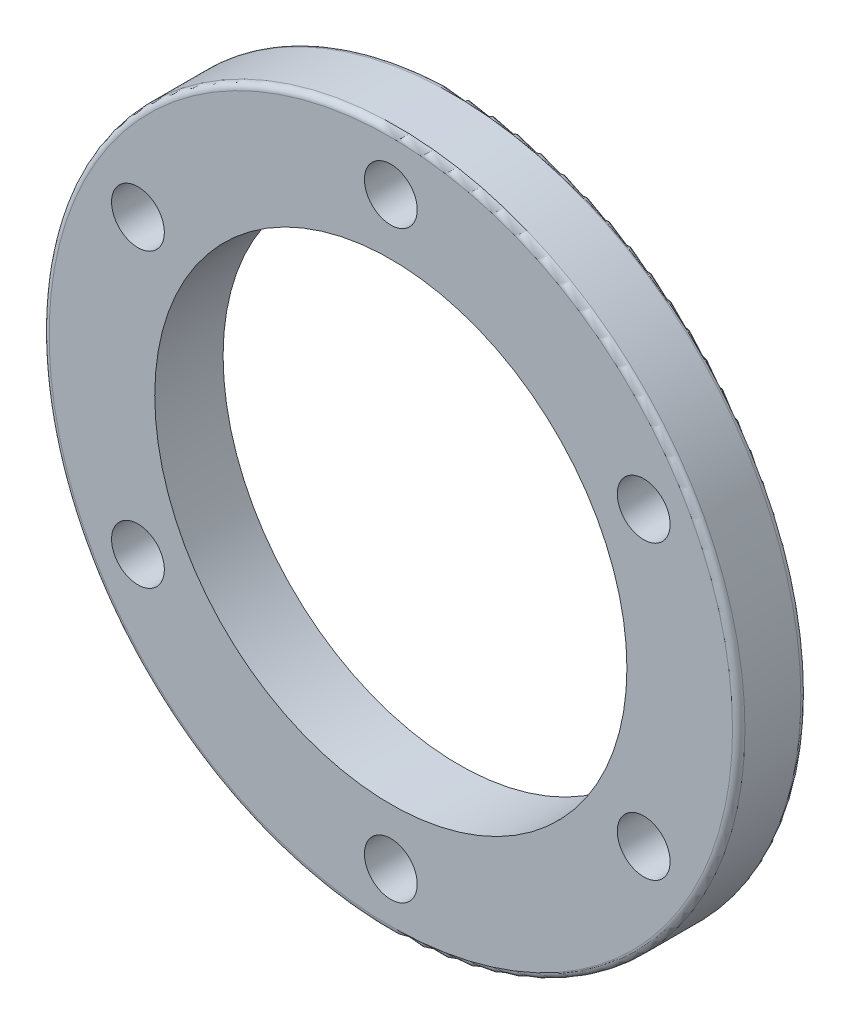
ISO-10303-21;
HEADER;
FILE_DESCRIPTION(('STEP AP214'),'2;1');
FILE_NAME('part.step','',(''),(''),'','','');
FILE_SCHEMA(('AUTOMOTIVE_DESIGN { 1 0 10303 214 1 1 1 1 }'));
ENDSEC;
DATA;
#1=APPLICATION_CONTEXT('core data for automotive mechanical design processes');
#2=APPLICATION_PROTOCOL_DEFINITION('international standard','automotive_design',2000,#1);
#3=PRODUCT_CONTEXT('',#1,'mechanical');
#4=PRODUCT('Part','Part','',(#3));
#5=PRODUCT_RELATED_PRODUCT_CATEGORY('part','',(#4));
#6=PRODUCT_DEFINITION_FORMATION('','',#4);
#7=PRODUCT_DEFINITION_CONTEXT('part definition',#1,'design');
#8=PRODUCT_DEFINITION('design','',#6,#7);
#9=PRODUCT_DEFINITION_SHAPE('','',#8);
#10=(LENGTH_UNIT() NAMED_UNIT(*) SI_UNIT(.MILLI.,.METRE.));
#11=(NAMED_UNIT(*) PLANE_ANGLE_UNIT() SI_UNIT($,.RADIAN.));
#12=(NAMED_UNIT(*) SI_UNIT($,.STERADIAN.) SOLID_ANGLE_UNIT());
#13=UNCERTAINTY_MEASURE_WITH_UNIT(LENGTH_MEASURE(1.E-05),#10,'distance_accuracy_value','');
#14=(GEOMETRIC_REPRESENTATION_CONTEXT(3) GLOBAL_UNCERTAINTY_ASSIGNED_CONTEXT((#13)) GLOBAL_UNIT_ASSIGNED_CONTEXT((#10,
#11,#12)) REPRESENTATION_CONTEXT('',''));
#15=CARTESIAN_POINT('',(0.,0.,0.));
#16=DIRECTION('',(0.,0.,1.));
#17=DIRECTION('',(1.,0.,0.));
#18=AXIS2_PLACEMENT_3D('',#15,#16,#17);
#19=CARTESIAN_POINT('',(0.,0.,11.));
#20=DIRECTION('',(0.,0.,1.));
#21=DIRECTION('',(1.,0.,0.));
#22=AXIS2_PLACEMENT_3D('',#19,#20,#21);
#23=PLANE('',#22);
#24=CARTESIAN_POINT('',(0.,0.,11.));
#25=DIRECTION('',(0.,0.,1.));
#26=DIRECTION('',(1.,0.,0.));
#27=AXIS2_PLACEMENT_3D('',#24,#25,#26);
#28=CIRCLE('',#27,55.);
#29=CARTESIAN_POINT('',(55.,0.,11.));
#30=VERTEX_POINT('',#29);
#31=EDGE_CURVE('E48',#30,#30,#28,.T.);
#32=ORIENTED_EDGE('',*,*,#31,.T.);
#33=EDGE_LOOP('',(#32));
#34=FACE_BOUND('',#33,.T.);
#35=CARTESIAN_POINT('',(-40.7031939778686,-23.5,11.));
#36=DIRECTION('',(0.,0.,1.));
#37=DIRECTION('',(1.,0.,0.));
#38=AXIS2_PLACEMENT_3D('',#35,#36,#37);
#39=CIRCLE('',#38,4.25);
#40=CARTESIAN_POINT('',(-36.4531939778686,-23.5,11.));
#41=VERTEX_POINT('',#40);
#42=EDGE_CURVE('E90',#41,#41,#39,.T.);
#43=ORIENTED_EDGE('',*,*,#42,.F.);
#44=EDGE_LOOP('',(#43));
#45=FACE_BOUND('',#44,.T.);
#46=CARTESIAN_POINT('',(-40.7031939778686,23.5,11.));
#47=DIRECTION('',(0.,0.,1.));
#48=DIRECTION('',(1.,0.,0.));
#49=AXIS2_PLACEMENT_3D('',#46,#47,#48);
#50=CIRCLE('',#49,4.25);
#51=CARTESIAN_POINT('',(-36.4531939778686,23.5,11.));
#52=VERTEX_POINT('',#51);
#53=EDGE_CURVE('E84',#52,#52,#50,.T.);
#54=ORIENTED_EDGE('',*,*,#53,.F.);
#55=EDGE_LOOP('',(#54));
#56=FACE_BOUND('',#55,.T.);
#57=CARTESIAN_POINT('',(40.7031939778686,23.5,11.));
#58=DIRECTION('',(0.,0.,1.));
#59=DIRECTION('',(1.,0.,0.));
#60=AXIS2_PLACEMENT_3D('',#57,#58,#59);
#61=CIRCLE('',#60,4.25000000000002);
#62=CARTESIAN_POINT('',(44.9531939778687,23.5,11.));
#63=VERTEX_POINT('',#62);
#64=EDGE_CURVE('E78',#63,#63,#61,.T.);
#65=ORIENTED_EDGE('',*,*,#64,.F.);
#66=EDGE_LOOP('',(#65));
#67=FACE_BOUND('',#66,.T.);
#68=CARTESIAN_POINT('',(40.7031939778686,-23.5,11.));
#69=DIRECTION('',(0.,0.,1.));
#70=DIRECTION('',(1.,0.,0.));
#71=AXIS2_PLACEMENT_3D('',#68,#69,#70);
#72=CIRCLE('',#71,4.25);
#73=CARTESIAN_POINT('',(44.9531939778686,-23.5,11.));
#74=VERTEX_POINT('',#73);
#75=EDGE_CURVE('E72',#74,#74,#72,.T.);
#76=ORIENTED_EDGE('',*,*,#75,.F.);
#77=EDGE_LOOP('',(#76));
#78=FACE_BOUND('',#77,.T.);
#79=CARTESIAN_POINT('',(0.,-47.,11.));
#80=DIRECTION('',(0.,0.,1.));
#81=DIRECTION('',(1.,0.,0.));
#82=AXIS2_PLACEMENT_3D('',#79,#80,#81);
#83=CIRCLE('',#82,4.25000000000001);
#84=CARTESIAN_POINT('',(4.24999999999999,-47.,11.));
#85=VERTEX_POINT('',#84);
#86=EDGE_CURVE('E66',#85,#85,#83,.T.);
#87=ORIENTED_EDGE('',*,*,#86,.F.);
#88=EDGE_LOOP('',(#87));
#89=FACE_BOUND('',#88,.T.);
#90=CARTESIAN_POINT('',(0.,47.,11.));
#91=DIRECTION('',(0.,0.,1.));
#92=DIRECTION('',(1.,0.,0.));
#93=AXIS2_PLACEMENT_3D('',#90,#91,#92);
#94=CIRCLE('',#93,4.25000000000001);
#95=CARTESIAN_POINT('',(4.25000000000002,47.,11.));
#96=VERTEX_POINT('',#95);
#97=EDGE_CURVE('E60',#96,#96,#94,.T.);
#98=ORIENTED_EDGE('',*,*,#97,.F.);
#99=EDGE_LOOP('',(#98));
#100=FACE_BOUND('',#99,.T.);
#101=CARTESIAN_POINT('',(0.,0.,11.));
#102=DIRECTION('',(0.,0.,1.));
#103=DIRECTION('',(1.,0.,0.));
#104=AXIS2_PLACEMENT_3D('',#101,#102,#103);
#105=CIRCLE('',#104,38.);
#106=CARTESIAN_POINT('',(38.,0.,11.));
#107=VERTEX_POINT('',#106);
#108=EDGE_CURVE('E53',#107,#107,#105,.T.);
#109=ORIENTED_EDGE('',*,*,#108,.F.);
#110=EDGE_LOOP('',(#109));
#111=FACE_BOUND('',#110,.T.);
#112=ADVANCED_FACE('F33',(#34,#45,#56,#67,#78,#89,#100,#111),#23,.T.);
#113=CARTESIAN_POINT('',(0.,0.,0.));
#114=DIRECTION('',(0.,0.,1.));
#115=DIRECTION('',(1.,0.,0.));
#116=AXIS2_PLACEMENT_3D('',#113,#114,#115);
#117=PLANE('',#116);
#118=CARTESIAN_POINT('',(0.,0.,0.));
#119=DIRECTION('',(0.,0.,1.));
#120=DIRECTION('',(1.,0.,0.));
#121=AXIS2_PLACEMENT_3D('',#118,#119,#120);
#122=CIRCLE('',#121,55.);
#123=CARTESIAN_POINT('',(55.,0.,0.));
#124=VERTEX_POINT('',#123);
#125=EDGE_CURVE('E10',#124,#124,#122,.F.);
#126=ORIENTED_EDGE('',*,*,#125,.T.);
#127=EDGE_LOOP('',(#126));
#128=FACE_BOUND('',#127,.T.);
#129=CARTESIAN_POINT('',(-40.7031939778686,-23.5,0.));
#130=DIRECTION('',(0.,0.,1.));
#131=DIRECTION('',(1.,0.,0.));
#132=AXIS2_PLACEMENT_3D('',#129,#130,#131);
#133=CIRCLE('',#132,4.25);
#134=CARTESIAN_POINT('',(-36.4531939778686,-23.5,0.));
#135=VERTEX_POINT('',#134);
#136=EDGE_CURVE('E87',#135,#135,#133,.T.);
#137=ORIENTED_EDGE('',*,*,#136,.T.);
#138=EDGE_LOOP('',(#137));
#139=FACE_BOUND('',#138,.T.);
#140=CARTESIAN_POINT('',(-40.7031939778686,23.5,0.));
#141=DIRECTION('',(0.,0.,1.));
#142=DIRECTION('',(1.,0.,0.));
#143=AXIS2_PLACEMENT_3D('',#140,#141,#142);
#144=CIRCLE('',#143,4.25);
#145=CARTESIAN_POINT('',(-36.4531939778686,23.5,0.));
#146=VERTEX_POINT('',#145);
#147=EDGE_CURVE('E81',#146,#146,#144,.T.);
#148=ORIENTED_EDGE('',*,*,#147,.T.);
#149=EDGE_LOOP('',(#148));
#150=FACE_BOUND('',#149,.T.);
#151=CARTESIAN_POINT('',(40.7031939778686,23.5,0.));
#152=DIRECTION('',(0.,0.,1.));
#153=DIRECTION('',(1.,0.,0.));
#154=AXIS2_PLACEMENT_3D('',#151,#152,#153);
#155=CIRCLE('',#154,4.25000000000002);
#156=CARTESIAN_POINT('',(44.9531939778687,23.5,0.));
#157=VERTEX_POINT('',#156);
#158=EDGE_CURVE('E75',#157,#157,#155,.T.);
#159=ORIENTED_EDGE('',*,*,#158,.T.);
#160=EDGE_LOOP('',(#159));
#161=FACE_BOUND('',#160,.T.);
#162=CARTESIAN_POINT('',(40.7031939778686,-23.5,0.));
#163=DIRECTION('',(0.,0.,1.));
#164=DIRECTION('',(1.,0.,0.));
#165=AXIS2_PLACEMENT_3D('',#162,#163,#164);
#166=CIRCLE('',#165,4.25);
#167=CARTESIAN_POINT('',(44.9531939778686,-23.5,0.));
#168=VERTEX_POINT('',#167);
#169=EDGE_CURVE('E69',#168,#168,#166,.T.);
#170=ORIENTED_EDGE('',*,*,#169,.T.);
#171=EDGE_LOOP('',(#170));
#172=FACE_BOUND('',#171,.T.);
#173=CARTESIAN_POINT('',(0.,-47.,0.));
#174=DIRECTION('',(0.,0.,1.));
#175=DIRECTION('',(1.,0.,0.));
#176=AXIS2_PLACEMENT_3D('',#173,#174,#175);
#177=CIRCLE('',#176,4.25000000000001);
#178=CARTESIAN_POINT('',(4.24999999999999,-47.,0.));
#179=VERTEX_POINT('',#178);
#180=EDGE_CURVE('E63',#179,#179,#177,.T.);
#181=ORIENTED_EDGE('',*,*,#180,.T.);
#182=EDGE_LOOP('',(#181));
#183=FACE_BOUND('',#182,.T.);
#184=CARTESIAN_POINT('',(0.,47.,0.));
#185=DIRECTION('',(0.,0.,1.));
#186=DIRECTION('',(1.,0.,0.));
#187=AXIS2_PLACEMENT_3D('',#184,#185,#186);
#188=CIRCLE('',#187,4.25000000000001);
#189=CARTESIAN_POINT('',(4.25000000000002,47.,0.));
#190=VERTEX_POINT('',#189);
#191=EDGE_CURVE('E57',#190,#190,#188,.T.);
#192=ORIENTED_EDGE('',*,*,#191,.T.);
#193=EDGE_LOOP('',(#192));
#194=FACE_BOUND('',#193,.T.);
#195=CARTESIAN_POINT('',(0.,0.,0.));
#196=DIRECTION('',(0.,0.,1.));
#197=DIRECTION('',(1.,0.,0.));
#198=AXIS2_PLACEMENT_3D('',#195,#196,#197);
#199=CIRCLE('',#198,38.);
#200=CARTESIAN_POINT('',(38.,0.,0.));
#201=VERTEX_POINT('',#200);
#202=EDGE_CURVE('E54',#201,#201,#199,.T.);
#203=ORIENTED_EDGE('',*,*,#202,.T.);
#204=EDGE_LOOP('',(#203));
#205=FACE_BOUND('',#204,.T.);
#206=ADVANCED_FACE('F96',(#128,#139,#150,#161,#172,#183,#194,#205),#117,.F.);
#207=CARTESIAN_POINT('',(0.,0.,11.));
#208=DIRECTION('',(0.,0.,-1.));
#209=DIRECTION('',(-1.,0.,0.));
#210=AXIS2_PLACEMENT_3D('',#207,#208,#209);
#211=CYLINDRICAL_SURFACE('',#210,56.);
#212=CARTESIAN_POINT('',(0.,0.,1.));
#213=DIRECTION('',(0.,0.,1.));
#214=DIRECTION('',(1.,0.,0.));
#215=AXIS2_PLACEMENT_3D('',#212,#213,#214);
#216=CIRCLE('',#215,56.);
#217=CARTESIAN_POINT('',(56.,0.,1.));
#218=VERTEX_POINT('',#217);
#219=EDGE_CURVE('E40',#218,#218,#216,.T.);
#220=ORIENTED_EDGE('',*,*,#219,.T.);
#221=EDGE_LOOP('',(#220));
#222=FACE_BOUND('',#221,.T.);
#223=CARTESIAN_POINT('',(0.,0.,10.));
#224=DIRECTION('',(0.,0.,1.));
#225=DIRECTION('',(1.,0.,0.));
#226=AXIS2_PLACEMENT_3D('',#223,#224,#225);
#227=CIRCLE('',#226,56.);
#228=CARTESIAN_POINT('',(56.,0.,10.));
#229=VERTEX_POINT('',#228);
#230=EDGE_CURVE('E44',#229,#229,#227,.F.);
#231=ORIENTED_EDGE('',*,*,#230,.T.);
#232=EDGE_LOOP('',(#231));
#233=FACE_BOUND('',#232,.T.);
#234=ADVANCED_FACE('F127',(#222,#233),#211,.T.);
#235=CARTESIAN_POINT('',(0.,0.,11.));
#236=DIRECTION('',(0.,0.,-1.));
#237=DIRECTION('',(-1.,0.,0.));
#238=AXIS2_PLACEMENT_3D('',#235,#236,#237);
#239=CYLINDRICAL_SURFACE('',#238,38.);
#240=ORIENTED_EDGE('',*,*,#108,.T.);
#241=EDGE_LOOP('',(#240));
#242=FACE_BOUND('',#241,.T.);
#243=ORIENTED_EDGE('',*,*,#202,.F.);
#244=EDGE_LOOP('',(#243));
#245=FACE_BOUND('',#244,.T.);
#246=ADVANCED_FACE('F123',(#242,#245),#239,.F.);
#247=CARTESIAN_POINT('',(0.,47.,0.));
#248=DIRECTION('',(0.,0.,1.));
#249=DIRECTION('',(1.,0.,0.));
#250=AXIS2_PLACEMENT_3D('',#247,#248,#249);
#251=CYLINDRICAL_SURFACE('',#250,4.25000000000001);
#252=ORIENTED_EDGE('',*,*,#191,.F.);
#253=EDGE_LOOP('',(#252));
#254=FACE_BOUND('',#253,.T.);
#255=ORIENTED_EDGE('',*,*,#97,.T.);
#256=EDGE_LOOP('',(#255));
#257=FACE_BOUND('',#256,.T.);
#258=ADVANCED_FACE('F126',(#254,#257),#251,.F.);
#259=CARTESIAN_POINT('',(0.,-47.,0.));
#260=DIRECTION('',(0.,0.,1.));
#261=DIRECTION('',(1.,0.,0.));
#262=AXIS2_PLACEMENT_3D('',#259,#260,#261);
#263=CYLINDRICAL_SURFACE('',#262,4.25000000000001);
#264=ORIENTED_EDGE('',*,*,#180,.F.);
#265=EDGE_LOOP('',(#264));
#266=FACE_BOUND('',#265,.T.);
#267=ORIENTED_EDGE('',*,*,#86,.T.);
#268=EDGE_LOOP('',(#267));
#269=FACE_BOUND('',#268,.T.);
#270=ADVANCED_FACE('F206',(#266,#269),#263,.F.);
#271=CARTESIAN_POINT('',(40.7031939778686,-23.5,0.));
#272=DIRECTION('',(0.,0.,1.));
#273=DIRECTION('',(1.,0.,0.));
#274=AXIS2_PLACEMENT_3D('',#271,#272,#273);
#275=CYLINDRICAL_SURFACE('',#274,4.25);
#276=ORIENTED_EDGE('',*,*,#169,.F.);
#277=EDGE_LOOP('',(#276));
#278=FACE_BOUND('',#277,.T.);
#279=ORIENTED_EDGE('',*,*,#75,.T.);
#280=EDGE_LOOP('',(#279));
#281=FACE_BOUND('',#280,.T.);
#282=ADVANCED_FACE('F196',(#278,#281),#275,.F.);
#283=CARTESIAN_POINT('',(40.7031939778686,23.5,0.));
#284=DIRECTION('',(0.,0.,1.));
#285=DIRECTION('',(1.,0.,0.));
#286=AXIS2_PLACEMENT_3D('',#283,#284,#285);
#287=CYLINDRICAL_SURFACE('',#286,4.25000000000002);
#288=ORIENTED_EDGE('',*,*,#158,.F.);
#289=EDGE_LOOP('',(#288));
#290=FACE_BOUND('',#289,.T.);
#291=ORIENTED_EDGE('',*,*,#64,.T.);
#292=EDGE_LOOP('',(#291));
#293=FACE_BOUND('',#292,.T.);
#294=ADVANCED_FACE('F186',(#290,#293),#287,.F.);
#295=CARTESIAN_POINT('',(-40.7031939778686,23.5,0.));
#296=DIRECTION('',(0.,0.,1.));
#297=DIRECTION('',(1.,0.,0.));
#298=AXIS2_PLACEMENT_3D('',#295,#296,#297);
#299=CYLINDRICAL_SURFACE('',#298,4.25);
#300=ORIENTED_EDGE('',*,*,#147,.F.);
#301=EDGE_LOOP('',(#300));
#302=FACE_BOUND('',#301,.T.);
#303=ORIENTED_EDGE('',*,*,#53,.T.);
#304=EDGE_LOOP('',(#303));
#305=FACE_BOUND('',#304,.T.);
#306=ADVANCED_FACE('F103',(#302,#305),#299,.F.);
#307=CARTESIAN_POINT('',(-40.7031939778686,-23.5,0.));
#308=DIRECTION('',(0.,0.,1.));
#309=DIRECTION('',(1.,0.,0.));
#310=AXIS2_PLACEMENT_3D('',#307,#308,#309);
#311=CYLINDRICAL_SURFACE('',#310,4.25);
#312=ORIENTED_EDGE('',*,*,#136,.F.);
#313=EDGE_LOOP('',(#312));
#314=FACE_BOUND('',#313,.T.);
#315=ORIENTED_EDGE('',*,*,#42,.T.);
#316=EDGE_LOOP('',(#315));
#317=FACE_BOUND('',#316,.T.);
#318=ADVANCED_FACE('F99',(#314,#317),#311,.F.);
#319=CARTESIAN_POINT('',(0.,0.,10.));
#320=DIRECTION('',(0.,0.,1.));
#321=DIRECTION('',(1.,0.,0.));
#322=AXIS2_PLACEMENT_3D('',#319,#320,#321);
#323=TOROIDAL_SURFACE('',#322,55.,1.);
#324=ORIENTED_EDGE('',*,*,#230,.F.);
#325=EDGE_LOOP('',(#324));
#326=FACE_BOUND('',#325,.T.);
#327=ORIENTED_EDGE('',*,*,#31,.F.);
#328=EDGE_LOOP('',(#327));
#329=FACE_BOUND('',#328,.T.);
#330=ADVANCED_FACE('F102',(#326,#329),#323,.T.);
#331=CARTESIAN_POINT('',(0.,0.,1.));
#332=DIRECTION('',(0.,0.,1.));
#333=DIRECTION('',(1.,0.,0.));
#334=AXIS2_PLACEMENT_3D('',#331,#332,#333);
#335=TOROIDAL_SURFACE('',#334,55.,1.);
#336=ORIENTED_EDGE('',*,*,#125,.F.);
#337=EDGE_LOOP('',(#336));
#338=FACE_BOUND('',#337,.T.);
#339=ORIENTED_EDGE('',*,*,#219,.F.);
#340=EDGE_LOOP('',(#339));
#341=FACE_BOUND('',#340,.T.);
#342=ADVANCED_FACE('F35',(#338,#341),#335,.T.);
#343=CLOSED_SHELL('',(#112,#206,#234,#246,#258,#270,#282,#294,#306,#318,#330,#342));
#344=MANIFOLD_SOLID_BREP('B2',#343);
#345=ADVANCED_BREP_SHAPE_REPRESENTATION('',(#18,#344),#14);
#346=SHAPE_DEFINITION_REPRESENTATION(#9,#345);
ENDSEC;
END-ISO-10303-21;
